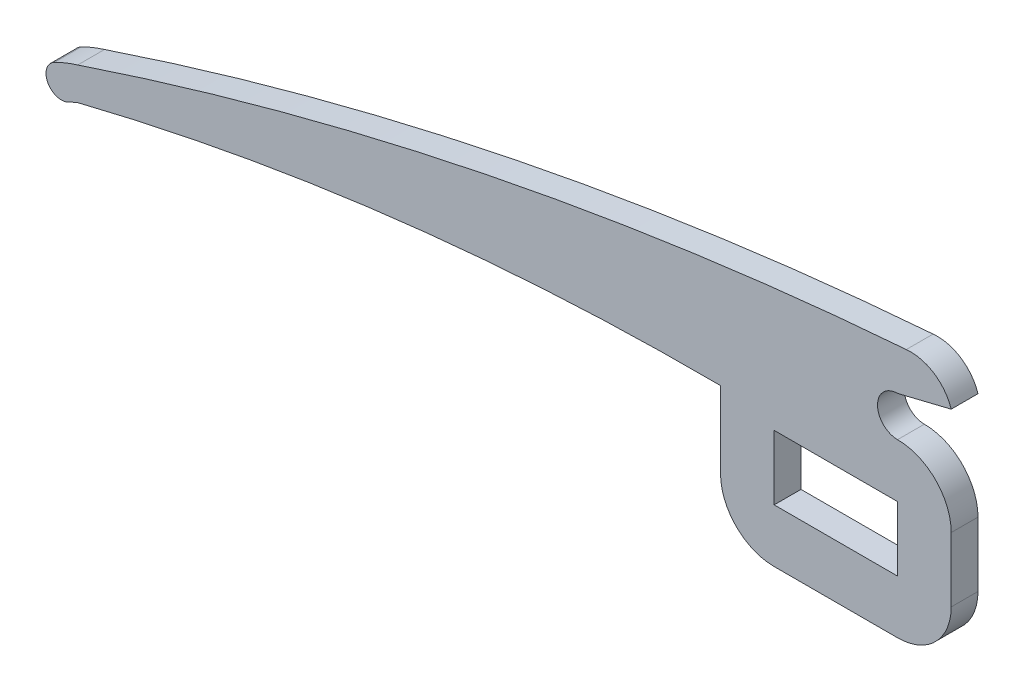
ISO-10303-21;
HEADER;
FILE_DESCRIPTION(('STEP AP214'),'2;1');
FILE_NAME('part.step','',(''),(''),'','','');
FILE_SCHEMA(('AUTOMOTIVE_DESIGN { 1 0 10303 214 1 1 1 1 }'));
ENDSEC;
DATA;
#1=APPLICATION_CONTEXT('core data for automotive mechanical design processes');
#2=APPLICATION_PROTOCOL_DEFINITION('international standard','automotive_design',2000,#1);
#3=PRODUCT_CONTEXT('',#1,'mechanical');
#4=PRODUCT('Part','Part','',(#3));
#5=PRODUCT_RELATED_PRODUCT_CATEGORY('part','',(#4));
#6=PRODUCT_DEFINITION_FORMATION('','',#4);
#7=PRODUCT_DEFINITION_CONTEXT('part definition',#1,'design');
#8=PRODUCT_DEFINITION('design','',#6,#7);
#9=PRODUCT_DEFINITION_SHAPE('','',#8);
#10=(LENGTH_UNIT() NAMED_UNIT(*) SI_UNIT(.MILLI.,.METRE.));
#11=(NAMED_UNIT(*) PLANE_ANGLE_UNIT() SI_UNIT($,.RADIAN.));
#12=(NAMED_UNIT(*) SI_UNIT($,.STERADIAN.) SOLID_ANGLE_UNIT());
#13=UNCERTAINTY_MEASURE_WITH_UNIT(LENGTH_MEASURE(1.E-05),#10,'distance_accuracy_value','');
#14=(GEOMETRIC_REPRESENTATION_CONTEXT(3) GLOBAL_UNCERTAINTY_ASSIGNED_CONTEXT((#13)) GLOBAL_UNIT_ASSIGNED_CONTEXT((#10,
#11,#12)) REPRESENTATION_CONTEXT('',''));
#15=CARTESIAN_POINT('',(0.,0.,0.));
#16=DIRECTION('',(0.,0.,1.));
#17=DIRECTION('',(1.,0.,0.));
#18=AXIS2_PLACEMENT_3D('',#15,#16,#17);
#19=CARTESIAN_POINT('',(-23.0294986436589,0.0187253464755182,-5.00000000000001));
#20=DIRECTION('',(0.,0.,1.));
#21=DIRECTION('',(-1.,0.,0.));
#22=AXIS2_PLACEMENT_3D('',#19,#20,#21);
#23=PLANE('',#22);
#24=CARTESIAN_POINT('',(-23.0294986436589,0.0187253464755182,-5.00000000000001));
#25=DIRECTION('',(0.,0.,1.));
#26=DIRECTION('',(-1.,0.,0.));
#27=AXIS2_PLACEMENT_3D('',#24,#25,#26);
#28=CIRCLE('',#27,9.98825294289375);
#29=CARTESIAN_POINT('',(-33.0177515865527,0.0187253464755182,-5.00000000000001));
#30=VERTEX_POINT('',#29);
#31=CARTESIAN_POINT('',(-23.0294986436589,-9.96952759641823,-5.00000000000001));
#32=VERTEX_POINT('',#31);
#33=EDGE_CURVE('E194',#30,#32,#28,.T.);
#34=ORIENTED_EDGE('',*,*,#33,.F.);
#35=DIRECTION('',(0.,-1.,0.));
#36=VECTOR('',#35,1.);
#37=CARTESIAN_POINT('',(-33.0177515865527,12.0354297745259,-5.00000000000001));
#38=LINE('',#37,#36);
#39=CARTESIAN_POINT('',(-33.0177515865527,14.2611248407662,-5.00000000000001));
#40=VERTEX_POINT('',#39);
#41=EDGE_CURVE('E234',#40,#30,#38,.T.);
#42=ORIENTED_EDGE('',*,*,#41,.F.);
#43=CARTESIAN_POINT('',(-36.4351616334843,-468.822459355462,-5.00000000000001));
#44=DIRECTION('',(0.,0.,-1.));
#45=DIRECTION('',(-1.,0.,0.));
#46=AXIS2_PLACEMENT_3D('',#43,#44,#45);
#47=CIRCLE('',#46,483.09567169589);
#48=CARTESIAN_POINT('',(-152.922807066753,0.0187253464755122,-5.00000000000001));
#49=VERTEX_POINT('',#48);
#50=EDGE_CURVE('E231',#49,#40,#47,.T.);
#51=ORIENTED_EDGE('',*,*,#50,.F.);
#52=CARTESIAN_POINT('',(-144.888159070749,-20.1160943851825,-5.00000000000001));
#53=DIRECTION('',(0.,0.,-1.));
#54=DIRECTION('',(-1.,0.,0.));
#55=AXIS2_PLACEMENT_3D('',#52,#53,#54);
#56=CIRCLE('',#55,21.6787115402656);
#57=CARTESIAN_POINT('',(-154.6706536097,-0.770052551219726,-5.00000000000001));
#58=VERTEX_POINT('',#57);
#59=EDGE_CURVE('E228',#58,#49,#56,.T.);
#60=ORIENTED_EDGE('',*,*,#59,.F.);
#61=CARTESIAN_POINT('',(-155.968002489383,1.79560854878484,-5.00000000000001));
#62=DIRECTION('',(0.,0.,1.));
#63=DIRECTION('',(1.,0.,0.));
#64=AXIS2_PLACEMENT_3D('',#61,#62,#63);
#65=CIRCLE('',#64,2.87501843397422);
#66=CARTESIAN_POINT('',(-157.265351369066,4.36126964878941,-5.00000000000001));
#67=VERTEX_POINT('',#66);
#68=EDGE_CURVE('E225',#67,#58,#65,.T.);
#69=ORIENTED_EDGE('',*,*,#68,.F.);
#70=CARTESIAN_POINT('',(-144.895449134273,-20.1016774209472,-5.00000000000001));
#71=DIRECTION('',(0.,0.,1.));
#72=DIRECTION('',(1.,0.,0.));
#73=AXIS2_PLACEMENT_3D('',#70,#71,#72);
#74=CIRCLE('',#73,27.412593103081);
#75=CARTESIAN_POINT('',(-152.922807066753,6.10923224008788,-5.00000000000001));
#76=VERTEX_POINT('',#75);
#77=EDGE_CURVE('E222',#76,#67,#74,.T.);
#78=ORIENTED_EDGE('',*,*,#77,.F.);
#79=CARTESIAN_POINT('',(50.6287042659373,-601.67086758297,-5.00000000000001));
#80=DIRECTION('',(0.,0.,1.));
#81=DIRECTION('',(-1.,0.,0.));
#82=AXIS2_PLACEMENT_3D('',#79,#80,#81);
#83=CIRCLE('',#82,640.960113818909);
#84=CARTESIAN_POINT('',(1.63153585656594,37.4137473113427,-5.00000000000001));
#85=VERTEX_POINT('',#84);
#86=EDGE_CURVE('E219',#85,#76,#83,.T.);
#87=ORIENTED_EDGE('',*,*,#86,.F.);
#88=CARTESIAN_POINT('',(2.45471137361272,29.5135318828524,-5.00000000000001));
#89=DIRECTION('',(0.,0.,1.));
#90=DIRECTION('',(-1.,0.,0.));
#91=AXIS2_PLACEMENT_3D('',#88,#89,#90);
#92=CIRCLE('',#91,7.94298569483932);
#93=CARTESIAN_POINT('',(10.0096306656655,31.9659217863935,-5.00000000000001));
#94=VERTEX_POINT('',#93);
#95=EDGE_CURVE('E216',#94,#85,#92,.T.);
#96=ORIENTED_EDGE('',*,*,#95,.F.);
#97=DIRECTION('',(0.971260967002743,0.238017087573342,0.));
#98=VECTOR('',#97,1.);
#99=CARTESIAN_POINT('',(10.0096306656655,31.9659217863935,-5.00000000000001));
#100=LINE('',#99,#98);
#101=CARTESIAN_POINT('',(0.00232147007218474,29.5135318828524,-5.00000000000001));
#102=VERTEX_POINT('',#101);
#103=EDGE_CURVE('E213',#102,#94,#100,.T.);
#104=ORIENTED_EDGE('',*,*,#103,.F.);
#105=CARTESIAN_POINT('',(0.00232147007218232,25.7769746913497,-5.00000000000001));
#106=DIRECTION('',(0.,0.,-1.));
#107=DIRECTION('',(1.,0.,0.));
#108=AXIS2_PLACEMENT_3D('',#105,#106,#107);
#109=CIRCLE('',#108,3.73655719150275);
#110=CARTESIAN_POINT('',(0.00232147007218495,22.0404174998469,-5.00000000000001));
#111=VERTEX_POINT('',#110);
#112=EDGE_CURVE('E210',#111,#102,#109,.T.);
#113=ORIENTED_EDGE('',*,*,#112,.F.);
#114=CARTESIAN_POINT('',(0.00232147007218474,12.0331080349892,-5.00000000000001));
#115=DIRECTION('',(0.,0.,1.));
#116=DIRECTION('',(-1.,0.,0.));
#117=AXIS2_PLACEMENT_3D('',#114,#115,#116);
#118=CIRCLE('',#117,10.0073094648578);
#119=CARTESIAN_POINT('',(10.0096306656655,12.0354295052616,-5.00000000000001));
#120=VERTEX_POINT('',#119);
#121=EDGE_CURVE('E207',#120,#111,#118,.T.);
#122=ORIENTED_EDGE('',*,*,#121,.F.);
#123=DIRECTION('',(0.,1.,0.));
#124=VECTOR('',#123,1.);
#125=CARTESIAN_POINT('',(10.0096306656655,12.0354295052616,-5.00000000000001));
#126=LINE('',#125,#124);
#127=CARTESIAN_POINT('',(10.0096306656655,0.0200437648131177,-5.00000000000001));
#128=VERTEX_POINT('',#127);
#129=EDGE_CURVE('E204',#128,#120,#126,.T.);
#130=ORIENTED_EDGE('',*,*,#129,.F.);
#131=CARTESIAN_POINT('',(0.0200590351698421,0.0200440340774669,-5.00000000000001));
#132=DIRECTION('',(0.,0.,1.));
#133=DIRECTION('',(-1.,0.,0.));
#134=AXIS2_PLACEMENT_3D('',#131,#132,#133);
#135=CIRCLE('',#134,9.9895716304957);
#136=CARTESIAN_POINT('',(0.0200590351698439,-9.96952759641824,-5.00000000000001));
#137=VERTEX_POINT('',#136);
#138=EDGE_CURVE('E201',#137,#128,#135,.T.);
#139=ORIENTED_EDGE('',*,*,#138,.F.);
#140=DIRECTION('',(1.,0.,0.));
#141=VECTOR('',#140,1.);
#142=CARTESIAN_POINT('',(-23.0294986436589,-9.96952759641823,-5.00000000000001));
#143=LINE('',#142,#141);
#144=EDGE_CURVE('E197',#32,#137,#143,.T.);
#145=ORIENTED_EDGE('',*,*,#144,.F.);
#146=EDGE_LOOP('',(#34,#42,#51,#60,#69,#78,#87,#96,#104,#113,#122,#130,#139,#145));
#147=FACE_BOUND('',#146,.T.);
#148=DIRECTION('',(0.,1.,0.));
#149=VECTOR('',#148,1.);
#150=CARTESIAN_POINT('',(0.,12.0354297745259,-5.00000000000001));
#151=LINE('',#150,#149);
#152=CARTESIAN_POINT('',(0.,0.,-5.00000000000001));
#153=VERTEX_POINT('',#152);
#154=CARTESIAN_POINT('',(0.,12.0354297745259,-5.00000000000001));
#155=VERTEX_POINT('',#154);
#156=EDGE_CURVE('E162',#153,#155,#151,.T.);
#157=ORIENTED_EDGE('',*,*,#156,.T.);
#158=DIRECTION('',(-1.,0.,0.));
#159=VECTOR('',#158,1.);
#160=CARTESIAN_POINT('',(-23.0107908497502,12.0354297745259,-5.00000000000001));
#161=LINE('',#160,#159);
#162=CARTESIAN_POINT('',(-23.0107908497502,12.0354297745259,-5.00000000000001));
#163=VERTEX_POINT('',#162);
#164=EDGE_CURVE('E171',#155,#163,#161,.T.);
#165=ORIENTED_EDGE('',*,*,#164,.T.);
#166=DIRECTION('',(0.,-1.,0.));
#167=VECTOR('',#166,1.);
#168=CARTESIAN_POINT('',(-23.0107908497502,0.,-5.00000000000001));
#169=LINE('',#168,#167);
#170=CARTESIAN_POINT('',(-23.0107908497502,0.,-5.00000000000001));
#171=VERTEX_POINT('',#170);
#172=EDGE_CURVE('E175',#163,#171,#169,.T.);
#173=ORIENTED_EDGE('',*,*,#172,.T.);
#174=DIRECTION('',(1.,0.,0.));
#175=VECTOR('',#174,1.);
#176=CARTESIAN_POINT('',(0.,0.,-5.00000000000001));
#177=LINE('',#176,#175);
#178=EDGE_CURVE('E178',#171,#153,#177,.T.);
#179=ORIENTED_EDGE('',*,*,#178,.T.);
#180=EDGE_LOOP('',(#157,#165,#173,#179));
#181=FACE_BOUND('',#180,.T.);
#182=ADVANCED_FACE('F35',(#147,#181),#23,.F.);
#183=CARTESIAN_POINT('',(-23.0294986436589,0.0187253464755182,0.));
#184=DIRECTION('',(0.,0.,1.));
#185=DIRECTION('',(-1.,0.,0.));
#186=AXIS2_PLACEMENT_3D('',#183,#184,#185);
#187=PLANE('',#186);
#188=CARTESIAN_POINT('',(-23.0294986436589,0.0187253464755182,0.));
#189=DIRECTION('',(0.,0.,1.));
#190=DIRECTION('',(-1.,0.,0.));
#191=AXIS2_PLACEMENT_3D('',#188,#189,#190);
#192=CIRCLE('',#191,9.98825294289375);
#193=CARTESIAN_POINT('',(-33.0177515865527,0.0187253464755182,0.));
#194=VERTEX_POINT('',#193);
#195=CARTESIAN_POINT('',(-23.0294986436589,-9.96952759641823,0.));
#196=VERTEX_POINT('',#195);
#197=EDGE_CURVE('E167',#194,#196,#192,.T.);
#198=ORIENTED_EDGE('',*,*,#197,.T.);
#199=DIRECTION('',(1.,0.,0.));
#200=VECTOR('',#199,1.);
#201=CARTESIAN_POINT('',(-23.0294986436589,-9.96952759641823,0.));
#202=LINE('',#201,#200);
#203=CARTESIAN_POINT('',(0.0200590351698439,-9.96952759641824,0.));
#204=VERTEX_POINT('',#203);
#205=EDGE_CURVE('E240',#196,#204,#202,.T.);
#206=ORIENTED_EDGE('',*,*,#205,.T.);
#207=CARTESIAN_POINT('',(0.0200590351698421,0.0200440340774669,0.));
#208=DIRECTION('',(0.,0.,1.));
#209=DIRECTION('',(-1.,0.,0.));
#210=AXIS2_PLACEMENT_3D('',#207,#208,#209);
#211=CIRCLE('',#210,9.9895716304957);
#212=CARTESIAN_POINT('',(10.0096306656655,0.0200437648131177,0.));
#213=VERTEX_POINT('',#212);
#214=EDGE_CURVE('E243',#204,#213,#211,.T.);
#215=ORIENTED_EDGE('',*,*,#214,.T.);
#216=DIRECTION('',(0.,1.,0.));
#217=VECTOR('',#216,1.);
#218=CARTESIAN_POINT('',(10.0096306656655,12.0354295052616,0.));
#219=LINE('',#218,#217);
#220=CARTESIAN_POINT('',(10.0096306656655,12.0354295052616,0.));
#221=VERTEX_POINT('',#220);
#222=EDGE_CURVE('E246',#213,#221,#219,.T.);
#223=ORIENTED_EDGE('',*,*,#222,.T.);
#224=CARTESIAN_POINT('',(0.00232147007218474,12.0331080349892,0.));
#225=DIRECTION('',(0.,0.,1.));
#226=DIRECTION('',(-1.,0.,0.));
#227=AXIS2_PLACEMENT_3D('',#224,#225,#226);
#228=CIRCLE('',#227,10.0073094648578);
#229=CARTESIAN_POINT('',(0.00232147007218495,22.0404174998469,0.));
#230=VERTEX_POINT('',#229);
#231=EDGE_CURVE('E249',#221,#230,#228,.T.);
#232=ORIENTED_EDGE('',*,*,#231,.T.);
#233=CARTESIAN_POINT('',(0.00232147007218232,25.7769746913497,0.));
#234=DIRECTION('',(0.,0.,-1.));
#235=DIRECTION('',(1.,0.,0.));
#236=AXIS2_PLACEMENT_3D('',#233,#234,#235);
#237=CIRCLE('',#236,3.73655719150275);
#238=CARTESIAN_POINT('',(0.00232147007218474,29.5135318828524,0.));
#239=VERTEX_POINT('',#238);
#240=EDGE_CURVE('E252',#230,#239,#237,.T.);
#241=ORIENTED_EDGE('',*,*,#240,.T.);
#242=DIRECTION('',(0.971260967002743,0.238017087573342,0.));
#243=VECTOR('',#242,1.);
#244=CARTESIAN_POINT('',(10.0096306656655,31.9659217863935,0.));
#245=LINE('',#244,#243);
#246=CARTESIAN_POINT('',(10.0096306656655,31.9659217863935,0.));
#247=VERTEX_POINT('',#246);
#248=EDGE_CURVE('E255',#239,#247,#245,.T.);
#249=ORIENTED_EDGE('',*,*,#248,.T.);
#250=CARTESIAN_POINT('',(2.45471137361272,29.5135318828524,0.));
#251=DIRECTION('',(0.,0.,1.));
#252=DIRECTION('',(-1.,0.,0.));
#253=AXIS2_PLACEMENT_3D('',#250,#251,#252);
#254=CIRCLE('',#253,7.94298569483932);
#255=CARTESIAN_POINT('',(1.63153585656594,37.4137473113427,0.));
#256=VERTEX_POINT('',#255);
#257=EDGE_CURVE('E258',#247,#256,#254,.T.);
#258=ORIENTED_EDGE('',*,*,#257,.T.);
#259=CARTESIAN_POINT('',(50.6287042659373,-601.67086758297,0.));
#260=DIRECTION('',(0.,0.,1.));
#261=DIRECTION('',(-1.,0.,0.));
#262=AXIS2_PLACEMENT_3D('',#259,#260,#261);
#263=CIRCLE('',#262,640.960113818909);
#264=CARTESIAN_POINT('',(-152.922807066753,6.10923224008788,0.));
#265=VERTEX_POINT('',#264);
#266=EDGE_CURVE('E261',#256,#265,#263,.T.);
#267=ORIENTED_EDGE('',*,*,#266,.T.);
#268=CARTESIAN_POINT('',(-144.895449134273,-20.1016774209472,0.));
#269=DIRECTION('',(0.,0.,1.));
#270=DIRECTION('',(1.,0.,0.));
#271=AXIS2_PLACEMENT_3D('',#268,#269,#270);
#272=CIRCLE('',#271,27.412593103081);
#273=CARTESIAN_POINT('',(-157.265351369066,4.36126964878941,0.));
#274=VERTEX_POINT('',#273);
#275=EDGE_CURVE('E264',#265,#274,#272,.T.);
#276=ORIENTED_EDGE('',*,*,#275,.T.);
#277=CARTESIAN_POINT('',(-155.968002489383,1.79560854878484,0.));
#278=DIRECTION('',(0.,0.,1.));
#279=DIRECTION('',(1.,0.,0.));
#280=AXIS2_PLACEMENT_3D('',#277,#278,#279);
#281=CIRCLE('',#280,2.87501843397422);
#282=CARTESIAN_POINT('',(-154.6706536097,-0.770052551219726,0.));
#283=VERTEX_POINT('',#282);
#284=EDGE_CURVE('E267',#274,#283,#281,.T.);
#285=ORIENTED_EDGE('',*,*,#284,.T.);
#286=CARTESIAN_POINT('',(-144.888159070749,-20.1160943851825,0.));
#287=DIRECTION('',(0.,0.,-1.));
#288=DIRECTION('',(-1.,0.,0.));
#289=AXIS2_PLACEMENT_3D('',#286,#287,#288);
#290=CIRCLE('',#289,21.6787115402656);
#291=CARTESIAN_POINT('',(-152.922807066753,0.0187253464755122,0.));
#292=VERTEX_POINT('',#291);
#293=EDGE_CURVE('E270',#283,#292,#290,.T.);
#294=ORIENTED_EDGE('',*,*,#293,.T.);
#295=CARTESIAN_POINT('',(-36.4351616334843,-468.822459355462,0.));
#296=DIRECTION('',(0.,0.,-1.));
#297=DIRECTION('',(-1.,0.,0.));
#298=AXIS2_PLACEMENT_3D('',#295,#296,#297);
#299=CIRCLE('',#298,483.09567169589);
#300=CARTESIAN_POINT('',(-33.0177515865527,14.2611248407662,0.));
#301=VERTEX_POINT('',#300);
#302=EDGE_CURVE('E273',#292,#301,#299,.T.);
#303=ORIENTED_EDGE('',*,*,#302,.T.);
#304=DIRECTION('',(0.,-1.,0.));
#305=VECTOR('',#304,1.);
#306=CARTESIAN_POINT('',(-33.0177515865527,12.0354297745259,0.));
#307=LINE('',#306,#305);
#308=EDGE_CURVE('E198',#301,#194,#307,.T.);
#309=ORIENTED_EDGE('',*,*,#308,.T.);
#310=EDGE_LOOP('',(#198,#206,#215,#223,#232,#241,#249,#258,#267,#276,#285,#294,#303,#309));
#311=FACE_BOUND('',#310,.T.);
#312=DIRECTION('',(1.,0.,0.));
#313=VECTOR('',#312,1.);
#314=CARTESIAN_POINT('',(0.,0.,0.));
#315=LINE('',#314,#313);
#316=CARTESIAN_POINT('',(-23.0107908497502,0.,0.));
#317=VERTEX_POINT('',#316);
#318=CARTESIAN_POINT('',(0.,0.,0.));
#319=VERTEX_POINT('',#318);
#320=EDGE_CURVE('E179',#317,#319,#315,.T.);
#321=ORIENTED_EDGE('',*,*,#320,.F.);
#322=DIRECTION('',(0.,-1.,0.));
#323=VECTOR('',#322,1.);
#324=CARTESIAN_POINT('',(-23.0107908497502,0.,0.));
#325=LINE('',#324,#323);
#326=CARTESIAN_POINT('',(-23.0107908497502,12.0354297745259,0.));
#327=VERTEX_POINT('',#326);
#328=EDGE_CURVE('E182',#327,#317,#325,.T.);
#329=ORIENTED_EDGE('',*,*,#328,.F.);
#330=DIRECTION('',(-1.,0.,0.));
#331=VECTOR('',#330,1.);
#332=CARTESIAN_POINT('',(-23.0107908497502,12.0354297745259,0.));
#333=LINE('',#332,#331);
#334=CARTESIAN_POINT('',(0.,12.0354297745259,0.));
#335=VERTEX_POINT('',#334);
#336=EDGE_CURVE('E188',#335,#327,#333,.T.);
#337=ORIENTED_EDGE('',*,*,#336,.F.);
#338=DIRECTION('',(0.,1.,0.));
#339=VECTOR('',#338,1.);
#340=CARTESIAN_POINT('',(0.,12.0354297745259,0.));
#341=LINE('',#340,#339);
#342=EDGE_CURVE('E163',#319,#335,#341,.T.);
#343=ORIENTED_EDGE('',*,*,#342,.F.);
#344=EDGE_LOOP('',(#321,#329,#337,#343));
#345=FACE_BOUND('',#344,.T.);
#346=ADVANCED_FACE('F310',(#311,#345),#187,.T.);
#347=CARTESIAN_POINT('',(-23.0294986436589,0.0187253464755182,-5.00000000000001));
#348=DIRECTION('',(0.,0.,1.));
#349=DIRECTION('',(-1.,0.,0.));
#350=AXIS2_PLACEMENT_3D('',#347,#348,#349);
#351=CYLINDRICAL_SURFACE('',#350,9.98825294289375);
#352=ORIENTED_EDGE('',*,*,#197,.F.);
#353=DIRECTION('',(0.,0.,1.));
#354=VECTOR('',#353,1.);
#355=CARTESIAN_POINT('',(-33.0177515865527,0.0187253464755182,-5.00000000000001));
#356=LINE('',#355,#354);
#357=EDGE_CURVE('E237',#30,#194,#356,.T.);
#358=ORIENTED_EDGE('',*,*,#357,.F.);
#359=ORIENTED_EDGE('',*,*,#33,.T.);
#360=DIRECTION('',(0.,0.,1.));
#361=VECTOR('',#360,1.);
#362=CARTESIAN_POINT('',(-23.0294986436589,-9.96952759641823,-5.00000000000001));
#363=LINE('',#362,#361);
#364=EDGE_CURVE('E11',#32,#196,#363,.T.);
#365=ORIENTED_EDGE('',*,*,#364,.T.);
#366=EDGE_LOOP('',(#352,#358,#359,#365));
#367=FACE_BOUND('',#366,.T.);
#368=ADVANCED_FACE('F37',(#367),#351,.T.);
#369=CARTESIAN_POINT('',(-23.0294986436589,-9.96952759641823,-5.00000000000001));
#370=DIRECTION('',(0.,1.,0.));
#371=DIRECTION('',(-1.,0.,0.));
#372=AXIS2_PLACEMENT_3D('',#369,#370,#371);
#373=PLANE('',#372);
#374=ORIENTED_EDGE('',*,*,#205,.F.);
#375=ORIENTED_EDGE('',*,*,#364,.F.);
#376=ORIENTED_EDGE('',*,*,#144,.T.);
#377=DIRECTION('',(0.,0.,1.));
#378=VECTOR('',#377,1.);
#379=CARTESIAN_POINT('',(0.0200590351698439,-9.96952759641824,-5.00000000000001));
#380=LINE('',#379,#378);
#381=EDGE_CURVE('E43',#137,#204,#380,.T.);
#382=ORIENTED_EDGE('',*,*,#381,.T.);
#383=EDGE_LOOP('',(#374,#375,#376,#382));
#384=FACE_BOUND('',#383,.T.);
#385=ADVANCED_FACE('F303',(#384),#373,.F.);
#386=CARTESIAN_POINT('',(0.0200590351698421,0.0200440340774669,-5.00000000000001));
#387=DIRECTION('',(0.,0.,1.));
#388=DIRECTION('',(-1.,0.,0.));
#389=AXIS2_PLACEMENT_3D('',#386,#387,#388);
#390=CYLINDRICAL_SURFACE('',#389,9.9895716304957);
#391=ORIENTED_EDGE('',*,*,#214,.F.);
#392=ORIENTED_EDGE('',*,*,#381,.F.);
#393=ORIENTED_EDGE('',*,*,#138,.T.);
#394=DIRECTION('',(0.,0.,1.));
#395=VECTOR('',#394,1.);
#396=CARTESIAN_POINT('',(10.0096306656655,0.0200437648131177,-5.00000000000001));
#397=LINE('',#396,#395);
#398=EDGE_CURVE('E299',#128,#213,#397,.T.);
#399=ORIENTED_EDGE('',*,*,#398,.T.);
#400=EDGE_LOOP('',(#391,#392,#393,#399));
#401=FACE_BOUND('',#400,.T.);
#402=ADVANCED_FACE('F307',(#401),#390,.T.);
#403=CARTESIAN_POINT('',(10.0096306656655,12.0354295052616,-5.00000000000001));
#404=DIRECTION('',(-1.,0.,0.));
#405=DIRECTION('',(0.,0.,-1.));
#406=AXIS2_PLACEMENT_3D('',#403,#404,#405);
#407=PLANE('',#406);
#408=ORIENTED_EDGE('',*,*,#222,.F.);
#409=ORIENTED_EDGE('',*,*,#398,.F.);
#410=ORIENTED_EDGE('',*,*,#129,.T.);
#411=DIRECTION('',(0.,0.,1.));
#412=VECTOR('',#411,1.);
#413=CARTESIAN_POINT('',(10.0096306656655,12.0354295052616,-5.00000000000001));
#414=LINE('',#413,#412);
#415=EDGE_CURVE('E297',#120,#221,#414,.T.);
#416=ORIENTED_EDGE('',*,*,#415,.T.);
#417=EDGE_LOOP('',(#408,#409,#410,#416));
#418=FACE_BOUND('',#417,.T.);
#419=ADVANCED_FACE('F322',(#418),#407,.F.);
#420=CARTESIAN_POINT('',(0.00232147007218474,12.0331080349892,-5.00000000000001));
#421=DIRECTION('',(0.,0.,1.));
#422=DIRECTION('',(-1.,0.,0.));
#423=AXIS2_PLACEMENT_3D('',#420,#421,#422);
#424=CYLINDRICAL_SURFACE('',#423,10.0073094648578);
#425=ORIENTED_EDGE('',*,*,#231,.F.);
#426=ORIENTED_EDGE('',*,*,#415,.F.);
#427=ORIENTED_EDGE('',*,*,#121,.T.);
#428=DIRECTION('',(0.,0.,1.));
#429=VECTOR('',#428,1.);
#430=CARTESIAN_POINT('',(0.00232147007218495,22.0404174998469,-5.00000000000001));
#431=LINE('',#430,#429);
#432=EDGE_CURVE('E295',#111,#230,#431,.T.);
#433=ORIENTED_EDGE('',*,*,#432,.T.);
#434=EDGE_LOOP('',(#425,#426,#427,#433));
#435=FACE_BOUND('',#434,.T.);
#436=ADVANCED_FACE('F326',(#435),#424,.T.);
#437=CARTESIAN_POINT('',(0.00232147007218232,25.7769746913497,-5.00000000000001));
#438=DIRECTION('',(0.,0.,1.));
#439=DIRECTION('',(-1.,0.,0.));
#440=AXIS2_PLACEMENT_3D('',#437,#438,#439);
#441=CYLINDRICAL_SURFACE('',#440,3.73655719150275);
#442=ORIENTED_EDGE('',*,*,#240,.F.);
#443=ORIENTED_EDGE('',*,*,#432,.F.);
#444=ORIENTED_EDGE('',*,*,#112,.T.);
#445=DIRECTION('',(0.,0.,1.));
#446=VECTOR('',#445,1.);
#447=CARTESIAN_POINT('',(0.00232147007218474,29.5135318828524,-5.00000000000001));
#448=LINE('',#447,#446);
#449=EDGE_CURVE('E293',#102,#239,#448,.T.);
#450=ORIENTED_EDGE('',*,*,#449,.T.);
#451=EDGE_LOOP('',(#442,#443,#444,#450));
#452=FACE_BOUND('',#451,.T.);
#453=ADVANCED_FACE('F328',(#452),#441,.F.);
#454=CARTESIAN_POINT('',(10.0096306656655,31.9659217863935,-5.00000000000001));
#455=DIRECTION('',(-0.238017087573342,0.971260967002743,0.));
#456=DIRECTION('',(-0.971260967002743,-0.238017087573342,0.));
#457=AXIS2_PLACEMENT_3D('',#454,#455,#456);
#458=PLANE('',#457);
#459=ORIENTED_EDGE('',*,*,#248,.F.);
#460=ORIENTED_EDGE('',*,*,#449,.F.);
#461=ORIENTED_EDGE('',*,*,#103,.T.);
#462=DIRECTION('',(0.,0.,1.));
#463=VECTOR('',#462,1.);
#464=CARTESIAN_POINT('',(10.0096306656655,31.9659217863935,-5.00000000000001));
#465=LINE('',#464,#463);
#466=EDGE_CURVE('E291',#94,#247,#465,.T.);
#467=ORIENTED_EDGE('',*,*,#466,.T.);
#468=EDGE_LOOP('',(#459,#460,#461,#467));
#469=FACE_BOUND('',#468,.T.);
#470=ADVANCED_FACE('F332',(#469),#458,.F.);
#471=CARTESIAN_POINT('',(2.45471137361272,29.5135318828524,-5.00000000000001));
#472=DIRECTION('',(0.,0.,1.));
#473=DIRECTION('',(-1.,0.,0.));
#474=AXIS2_PLACEMENT_3D('',#471,#472,#473);
#475=CYLINDRICAL_SURFACE('',#474,7.94298569483932);
#476=ORIENTED_EDGE('',*,*,#257,.F.);
#477=ORIENTED_EDGE('',*,*,#466,.F.);
#478=ORIENTED_EDGE('',*,*,#95,.T.);
#479=DIRECTION('',(0.,0.,1.));
#480=VECTOR('',#479,1.);
#481=CARTESIAN_POINT('',(1.63153585656594,37.4137473113427,-5.00000000000001));
#482=LINE('',#481,#480);
#483=EDGE_CURVE('E289',#85,#256,#482,.T.);
#484=ORIENTED_EDGE('',*,*,#483,.T.);
#485=EDGE_LOOP('',(#476,#477,#478,#484));
#486=FACE_BOUND('',#485,.T.);
#487=ADVANCED_FACE('F336',(#486),#475,.T.);
#488=CARTESIAN_POINT('',(50.6287042659373,-601.67086758297,-5.00000000000001));
#489=DIRECTION('',(0.,0.,1.));
#490=DIRECTION('',(-1.,0.,0.));
#491=AXIS2_PLACEMENT_3D('',#488,#489,#490);
#492=CYLINDRICAL_SURFACE('',#491,640.960113818909);
#493=ORIENTED_EDGE('',*,*,#266,.F.);
#494=ORIENTED_EDGE('',*,*,#483,.F.);
#495=ORIENTED_EDGE('',*,*,#86,.T.);
#496=DIRECTION('',(0.,0.,1.));
#497=VECTOR('',#496,1.);
#498=CARTESIAN_POINT('',(-152.922807066753,6.10923224008788,-5.00000000000001));
#499=LINE('',#498,#497);
#500=EDGE_CURVE('E287',#76,#265,#499,.T.);
#501=ORIENTED_EDGE('',*,*,#500,.T.);
#502=EDGE_LOOP('',(#493,#494,#495,#501));
#503=FACE_BOUND('',#502,.T.);
#504=ADVANCED_FACE('F340',(#503),#492,.T.);
#505=CARTESIAN_POINT('',(-144.895449134273,-20.1016774209472,-5.00000000000001));
#506=DIRECTION('',(0.,0.,1.));
#507=DIRECTION('',(-1.,0.,0.));
#508=AXIS2_PLACEMENT_3D('',#505,#506,#507);
#509=CYLINDRICAL_SURFACE('',#508,27.412593103081);
#510=ORIENTED_EDGE('',*,*,#275,.F.);
#511=ORIENTED_EDGE('',*,*,#500,.F.);
#512=ORIENTED_EDGE('',*,*,#77,.T.);
#513=DIRECTION('',(0.,0.,1.));
#514=VECTOR('',#513,1.);
#515=CARTESIAN_POINT('',(-157.265351369066,4.36126964878941,-5.00000000000001));
#516=LINE('',#515,#514);
#517=EDGE_CURVE('E285',#67,#274,#516,.T.);
#518=ORIENTED_EDGE('',*,*,#517,.T.);
#519=EDGE_LOOP('',(#510,#511,#512,#518));
#520=FACE_BOUND('',#519,.T.);
#521=ADVANCED_FACE('F344',(#520),#509,.T.);
#522=CARTESIAN_POINT('',(-155.968002489383,1.79560854878484,-5.00000000000001));
#523=DIRECTION('',(0.,0.,1.));
#524=DIRECTION('',(-1.,0.,0.));
#525=AXIS2_PLACEMENT_3D('',#522,#523,#524);
#526=CYLINDRICAL_SURFACE('',#525,2.87501843397422);
#527=ORIENTED_EDGE('',*,*,#284,.F.);
#528=ORIENTED_EDGE('',*,*,#517,.F.);
#529=ORIENTED_EDGE('',*,*,#68,.T.);
#530=DIRECTION('',(0.,0.,1.));
#531=VECTOR('',#530,1.);
#532=CARTESIAN_POINT('',(-154.6706536097,-0.770052551219726,-5.00000000000001));
#533=LINE('',#532,#531);
#534=EDGE_CURVE('E283',#58,#283,#533,.T.);
#535=ORIENTED_EDGE('',*,*,#534,.T.);
#536=EDGE_LOOP('',(#527,#528,#529,#535));
#537=FACE_BOUND('',#536,.T.);
#538=ADVANCED_FACE('F348',(#537),#526,.T.);
#539=CARTESIAN_POINT('',(-144.888159070749,-20.1160943851825,-5.00000000000001));
#540=DIRECTION('',(0.,0.,1.));
#541=DIRECTION('',(-1.,0.,0.));
#542=AXIS2_PLACEMENT_3D('',#539,#540,#541);
#543=CYLINDRICAL_SURFACE('',#542,21.6787115402656);
#544=ORIENTED_EDGE('',*,*,#293,.F.);
#545=ORIENTED_EDGE('',*,*,#534,.F.);
#546=ORIENTED_EDGE('',*,*,#59,.T.);
#547=DIRECTION('',(0.,0.,1.));
#548=VECTOR('',#547,1.);
#549=CARTESIAN_POINT('',(-152.922807066753,0.0187253464755122,-5.00000000000001));
#550=LINE('',#549,#548);
#551=EDGE_CURVE('E281',#49,#292,#550,.T.);
#552=ORIENTED_EDGE('',*,*,#551,.T.);
#553=EDGE_LOOP('',(#544,#545,#546,#552));
#554=FACE_BOUND('',#553,.T.);
#555=ADVANCED_FACE('F352',(#554),#543,.F.);
#556=CARTESIAN_POINT('',(-36.4351616334843,-468.822459355462,-5.00000000000001));
#557=DIRECTION('',(0.,0.,1.));
#558=DIRECTION('',(-1.,0.,0.));
#559=AXIS2_PLACEMENT_3D('',#556,#557,#558);
#560=CYLINDRICAL_SURFACE('',#559,483.09567169589);
#561=ORIENTED_EDGE('',*,*,#302,.F.);
#562=ORIENTED_EDGE('',*,*,#551,.F.);
#563=ORIENTED_EDGE('',*,*,#50,.T.);
#564=DIRECTION('',(0.,0.,1.));
#565=VECTOR('',#564,1.);
#566=CARTESIAN_POINT('',(-33.0177515865527,14.2611248407662,-5.00000000000001));
#567=LINE('',#566,#565);
#568=EDGE_CURVE('E279',#40,#301,#567,.T.);
#569=ORIENTED_EDGE('',*,*,#568,.T.);
#570=EDGE_LOOP('',(#561,#562,#563,#569));
#571=FACE_BOUND('',#570,.T.);
#572=ADVANCED_FACE('F356',(#571),#560,.F.);
#573=CARTESIAN_POINT('',(-33.0177515865527,12.0354297745259,-5.00000000000001));
#574=DIRECTION('',(1.,0.,0.));
#575=DIRECTION('',(0.,0.,1.));
#576=AXIS2_PLACEMENT_3D('',#573,#574,#575);
#577=PLANE('',#576);
#578=ORIENTED_EDGE('',*,*,#308,.F.);
#579=ORIENTED_EDGE('',*,*,#568,.F.);
#580=ORIENTED_EDGE('',*,*,#41,.T.);
#581=ORIENTED_EDGE('',*,*,#357,.T.);
#582=EDGE_LOOP('',(#578,#579,#580,#581));
#583=FACE_BOUND('',#582,.T.);
#584=ADVANCED_FACE('F358',(#583),#577,.F.);
#585=CARTESIAN_POINT('',(0.,12.0354297745259,-5.00000000000001));
#586=DIRECTION('',(-1.,0.,0.));
#587=DIRECTION('',(0.,0.,-1.));
#588=AXIS2_PLACEMENT_3D('',#585,#586,#587);
#589=PLANE('',#588);
#590=ORIENTED_EDGE('',*,*,#342,.T.);
#591=DIRECTION('',(0.,0.,1.));
#592=VECTOR('',#591,1.);
#593=CARTESIAN_POINT('',(0.,12.0354297745259,-5.00000000000001));
#594=LINE('',#593,#592);
#595=EDGE_CURVE('E158',#155,#335,#594,.T.);
#596=ORIENTED_EDGE('',*,*,#595,.F.);
#597=ORIENTED_EDGE('',*,*,#156,.F.);
#598=DIRECTION('',(0.,0.,1.));
#599=VECTOR('',#598,1.);
#600=CARTESIAN_POINT('',(0.,0.,-5.00000000000001));
#601=LINE('',#600,#599);
#602=EDGE_CURVE('E58',#153,#319,#601,.T.);
#603=ORIENTED_EDGE('',*,*,#602,.T.);
#604=EDGE_LOOP('',(#590,#596,#597,#603));
#605=FACE_BOUND('',#604,.T.);
#606=ADVANCED_FACE('F160',(#605),#589,.T.);
#607=CARTESIAN_POINT('',(-23.0107908497502,12.0354297745259,-5.00000000000001));
#608=DIRECTION('',(0.,-1.,0.));
#609=DIRECTION('',(1.,0.,0.));
#610=AXIS2_PLACEMENT_3D('',#607,#608,#609);
#611=PLANE('',#610);
#612=ORIENTED_EDGE('',*,*,#336,.T.);
#613=DIRECTION('',(0.,0.,1.));
#614=VECTOR('',#613,1.);
#615=CARTESIAN_POINT('',(-23.0107908497502,12.0354297745259,-5.00000000000001));
#616=LINE('',#615,#614);
#617=EDGE_CURVE('E168',#163,#327,#616,.T.);
#618=ORIENTED_EDGE('',*,*,#617,.F.);
#619=ORIENTED_EDGE('',*,*,#164,.F.);
#620=ORIENTED_EDGE('',*,*,#595,.T.);
#621=EDGE_LOOP('',(#612,#618,#619,#620));
#622=FACE_BOUND('',#621,.T.);
#623=ADVANCED_FACE('F172',(#622),#611,.T.);
#624=CARTESIAN_POINT('',(-23.0107908497502,0.,-5.00000000000001));
#625=DIRECTION('',(1.,0.,0.));
#626=DIRECTION('',(0.,0.,1.));
#627=AXIS2_PLACEMENT_3D('',#624,#625,#626);
#628=PLANE('',#627);
#629=ORIENTED_EDGE('',*,*,#328,.T.);
#630=DIRECTION('',(0.,0.,1.));
#631=VECTOR('',#630,1.);
#632=CARTESIAN_POINT('',(-23.0107908497502,0.,-5.00000000000001));
#633=LINE('',#632,#631);
#634=EDGE_CURVE('E50',#171,#317,#633,.T.);
#635=ORIENTED_EDGE('',*,*,#634,.F.);
#636=ORIENTED_EDGE('',*,*,#172,.F.);
#637=ORIENTED_EDGE('',*,*,#617,.T.);
#638=EDGE_LOOP('',(#629,#635,#636,#637));
#639=FACE_BOUND('',#638,.T.);
#640=ADVANCED_FACE('F376',(#639),#628,.T.);
#641=CARTESIAN_POINT('',(0.,0.,-5.00000000000001));
#642=DIRECTION('',(0.,1.,0.));
#643=DIRECTION('',(-1.,0.,0.));
#644=AXIS2_PLACEMENT_3D('',#641,#642,#643);
#645=PLANE('',#644);
#646=ORIENTED_EDGE('',*,*,#320,.T.);
#647=ORIENTED_EDGE('',*,*,#602,.F.);
#648=ORIENTED_EDGE('',*,*,#178,.F.);
#649=ORIENTED_EDGE('',*,*,#634,.T.);
#650=EDGE_LOOP('',(#646,#647,#648,#649));
#651=FACE_BOUND('',#650,.T.);
#652=ADVANCED_FACE('F379',(#651),#645,.T.);
#653=CLOSED_SHELL('',(#182,#346,#368,#385,#402,#419,#436,#453,#470,#487,#504,#521,#538,#555,
#572,#584,#606,#623,#640,#652));
#654=MANIFOLD_SOLID_BREP('B2',#653);
#655=ADVANCED_BREP_SHAPE_REPRESENTATION('',(#18,#654),#14);
#656=SHAPE_DEFINITION_REPRESENTATION(#9,#655);
ENDSEC;
END-ISO-10303-21;
